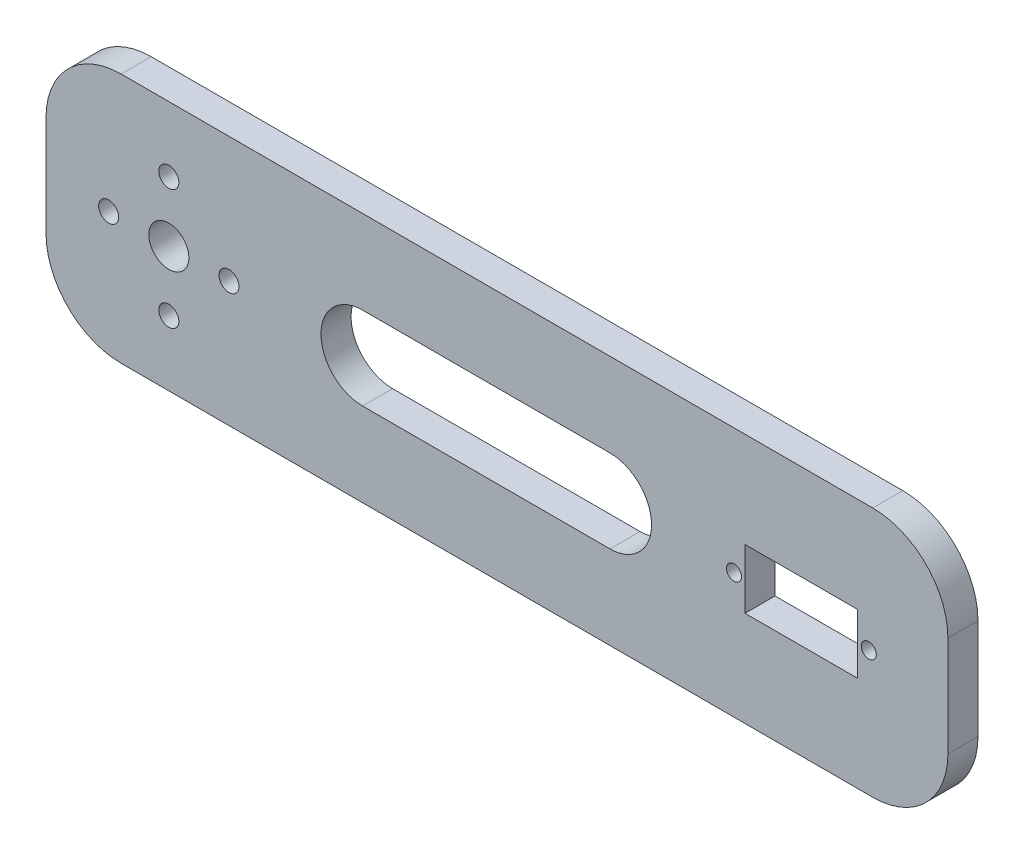
ISO-10303-21;
HEADER;
FILE_DESCRIPTION(('STEP AP214'),'2;1');
FILE_NAME('part.step','',(''),(''),'','','');
FILE_SCHEMA(('AUTOMOTIVE_DESIGN { 1 0 10303 214 1 1 1 1 }'));
ENDSEC;
DATA;
#1=APPLICATION_CONTEXT('core data for automotive mechanical design processes');
#2=APPLICATION_PROTOCOL_DEFINITION('international standard','automotive_design',2000,#1);
#3=PRODUCT_CONTEXT('',#1,'mechanical');
#4=PRODUCT('Part','Part','',(#3));
#5=PRODUCT_RELATED_PRODUCT_CATEGORY('part','',(#4));
#6=PRODUCT_DEFINITION_FORMATION('','',#4);
#7=PRODUCT_DEFINITION_CONTEXT('part definition',#1,'design');
#8=PRODUCT_DEFINITION('design','',#6,#7);
#9=PRODUCT_DEFINITION_SHAPE('','',#8);
#10=(LENGTH_UNIT() NAMED_UNIT(*) SI_UNIT(.MILLI.,.METRE.));
#11=(NAMED_UNIT(*) PLANE_ANGLE_UNIT() SI_UNIT($,.RADIAN.));
#12=(NAMED_UNIT(*) SI_UNIT($,.STERADIAN.) SOLID_ANGLE_UNIT());
#13=UNCERTAINTY_MEASURE_WITH_UNIT(LENGTH_MEASURE(1.E-05),#10,'distance_accuracy_value','');
#14=(GEOMETRIC_REPRESENTATION_CONTEXT(3) GLOBAL_UNCERTAINTY_ASSIGNED_CONTEXT((#13)) GLOBAL_UNIT_ASSIGNED_CONTEXT((#10,
#11,#12)) REPRESENTATION_CONTEXT('',''));
#15=CARTESIAN_POINT('',(0.,0.,0.));
#16=DIRECTION('',(0.,0.,1.));
#17=DIRECTION('',(1.,0.,0.));
#18=AXIS2_PLACEMENT_3D('',#15,#16,#17);
#19=CARTESIAN_POINT('',(107.559596495317,25.,3.));
#20=DIRECTION('',(-1.,0.,0.));
#21=DIRECTION('',(0.,0.,1.));
#22=AXIS2_PLACEMENT_3D('',#19,#20,#21);
#23=PLANE('',#22);
#24=DIRECTION('',(0.,1.,0.));
#25=VECTOR('',#24,1.);
#26=CARTESIAN_POINT('',(107.559596495317,25.,3.));
#27=LINE('',#26,#25);
#28=CARTESIAN_POINT('',(107.559596495317,-10.,3.));
#29=VERTEX_POINT('',#28);
#30=CARTESIAN_POINT('',(107.559596495317,10.,3.));
#31=VERTEX_POINT('',#30);
#32=EDGE_CURVE('E216',#29,#31,#27,.T.);
#33=ORIENTED_EDGE('',*,*,#32,.F.);
#34=DIRECTION('',(0.,0.,-1.));
#35=VECTOR('',#34,1.);
#36=CARTESIAN_POINT('',(107.559596495317,-10.,3.));
#37=LINE('',#36,#35);
#38=CARTESIAN_POINT('',(107.559596495317,-10.,-3.));
#39=VERTEX_POINT('',#38);
#40=EDGE_CURVE('E243',#29,#39,#37,.T.);
#41=ORIENTED_EDGE('',*,*,#40,.T.);
#42=DIRECTION('',(0.,1.,0.));
#43=VECTOR('',#42,1.);
#44=CARTESIAN_POINT('',(107.559596495317,25.,-3.));
#45=LINE('',#44,#43);
#46=CARTESIAN_POINT('',(107.559596495317,10.,-3.));
#47=VERTEX_POINT('',#46);
#48=EDGE_CURVE('E230',#39,#47,#45,.T.);
#49=ORIENTED_EDGE('',*,*,#48,.T.);
#50=DIRECTION('',(0.,0.,-1.));
#51=VECTOR('',#50,1.);
#52=CARTESIAN_POINT('',(107.559596495317,10.,3.));
#53=LINE('',#52,#51);
#54=EDGE_CURVE('E229',#47,#31,#53,.F.);
#55=ORIENTED_EDGE('',*,*,#54,.T.);
#56=EDGE_LOOP('',(#33,#41,#49,#55));
#57=FACE_BOUND('',#56,.T.);
#58=ADVANCED_FACE('F32',(#57),#23,.F.);
#59=CARTESIAN_POINT('',(-72.4404035046829,25.,3.));
#60=DIRECTION('',(0.,-1.,0.));
#61=DIRECTION('',(0.,0.,-1.));
#62=AXIS2_PLACEMENT_3D('',#59,#60,#61);
#63=PLANE('',#62);
#64=DIRECTION('',(-1.,0.,0.));
#65=VECTOR('',#64,1.);
#66=CARTESIAN_POINT('',(-72.4404035046829,25.,3.));
#67=LINE('',#66,#65);
#68=CARTESIAN_POINT('',(92.5595964953171,25.,3.));
#69=VERTEX_POINT('',#68);
#70=CARTESIAN_POINT('',(-57.4404035046829,25.,3.));
#71=VERTEX_POINT('',#70);
#72=EDGE_CURVE('E219',#69,#71,#67,.T.);
#73=ORIENTED_EDGE('',*,*,#72,.F.);
#74=DIRECTION('',(0.,0.,-1.));
#75=VECTOR('',#74,1.);
#76=CARTESIAN_POINT('',(92.5595964953171,25.,3.));
#77=LINE('',#76,#75);
#78=CARTESIAN_POINT('',(92.5595964953171,25.,-3.));
#79=VERTEX_POINT('',#78);
#80=EDGE_CURVE('E269',#69,#79,#77,.T.);
#81=ORIENTED_EDGE('',*,*,#80,.T.);
#82=DIRECTION('',(-1.,0.,0.));
#83=VECTOR('',#82,1.);
#84=CARTESIAN_POINT('',(-72.4404035046829,25.,-3.));
#85=LINE('',#84,#83);
#86=CARTESIAN_POINT('',(-57.4404035046829,25.,-3.));
#87=VERTEX_POINT('',#86);
#88=EDGE_CURVE('E233',#79,#87,#85,.T.);
#89=ORIENTED_EDGE('',*,*,#88,.T.);
#90=DIRECTION('',(0.,0.,-1.));
#91=VECTOR('',#90,1.);
#92=CARTESIAN_POINT('',(-57.4404035046829,25.,3.));
#93=LINE('',#92,#91);
#94=EDGE_CURVE('E267',#87,#71,#93,.F.);
#95=ORIENTED_EDGE('',*,*,#94,.T.);
#96=EDGE_LOOP('',(#73,#81,#89,#95));
#97=FACE_BOUND('',#96,.T.);
#98=ADVANCED_FACE('F330',(#97),#63,.F.);
#99=CARTESIAN_POINT('',(-72.4404035046829,25.,3.));
#100=DIRECTION('',(1.,0.,0.));
#101=DIRECTION('',(0.,0.,-1.));
#102=AXIS2_PLACEMENT_3D('',#99,#100,#101);
#103=PLANE('',#102);
#104=DIRECTION('',(0.,-1.,0.));
#105=VECTOR('',#104,1.);
#106=CARTESIAN_POINT('',(-72.4404035046829,25.,-3.));
#107=LINE('',#106,#105);
#108=CARTESIAN_POINT('',(-72.4404035046829,10.,-3.));
#109=VERTEX_POINT('',#108);
#110=CARTESIAN_POINT('',(-72.4404035046829,-10.,-3.));
#111=VERTEX_POINT('',#110);
#112=EDGE_CURVE('E237',#109,#111,#107,.T.);
#113=ORIENTED_EDGE('',*,*,#112,.T.);
#114=DIRECTION('',(0.,0.,-1.));
#115=VECTOR('',#114,1.);
#116=CARTESIAN_POINT('',(-72.4404035046829,-10.,3.));
#117=LINE('',#116,#115);
#118=CARTESIAN_POINT('',(-72.4404035046829,-10.,3.));
#119=VERTEX_POINT('',#118);
#120=EDGE_CURVE('E275',#111,#119,#117,.F.);
#121=ORIENTED_EDGE('',*,*,#120,.T.);
#122=DIRECTION('',(0.,-1.,0.));
#123=VECTOR('',#122,1.);
#124=CARTESIAN_POINT('',(-72.4404035046829,25.,3.));
#125=LINE('',#124,#123);
#126=CARTESIAN_POINT('',(-72.4404035046829,10.,3.));
#127=VERTEX_POINT('',#126);
#128=EDGE_CURVE('E223',#127,#119,#125,.T.);
#129=ORIENTED_EDGE('',*,*,#128,.F.);
#130=DIRECTION('',(0.,0.,-1.));
#131=VECTOR('',#130,1.);
#132=CARTESIAN_POINT('',(-72.4404035046829,10.,3.));
#133=LINE('',#132,#131);
#134=EDGE_CURVE('E272',#127,#109,#133,.T.);
#135=ORIENTED_EDGE('',*,*,#134,.T.);
#136=EDGE_LOOP('',(#113,#121,#129,#135));
#137=FACE_BOUND('',#136,.T.);
#138=ADVANCED_FACE('F336',(#137),#103,.F.);
#139=CARTESIAN_POINT('',(-72.4404035046829,-25.,3.));
#140=DIRECTION('',(0.,1.,0.));
#141=DIRECTION('',(0.,0.,1.));
#142=AXIS2_PLACEMENT_3D('',#139,#140,#141);
#143=PLANE('',#142);
#144=DIRECTION('',(1.,0.,0.));
#145=VECTOR('',#144,1.);
#146=CARTESIAN_POINT('',(-72.4404035046829,-25.,-3.));
#147=LINE('',#146,#145);
#148=CARTESIAN_POINT('',(-57.4404035046829,-25.,-3.));
#149=VERTEX_POINT('',#148);
#150=CARTESIAN_POINT('',(92.5595964953171,-25.,-3.));
#151=VERTEX_POINT('',#150);
#152=EDGE_CURVE('E220',#149,#151,#147,.T.);
#153=ORIENTED_EDGE('',*,*,#152,.T.);
#154=DIRECTION('',(0.,0.,-1.));
#155=VECTOR('',#154,1.);
#156=CARTESIAN_POINT('',(92.5595964953171,-25.,3.));
#157=LINE('',#156,#155);
#158=CARTESIAN_POINT('',(92.5595964953171,-25.,3.));
#159=VERTEX_POINT('',#158);
#160=EDGE_CURVE('E257',#151,#159,#157,.F.);
#161=ORIENTED_EDGE('',*,*,#160,.T.);
#162=DIRECTION('',(1.,0.,0.));
#163=VECTOR('',#162,1.);
#164=CARTESIAN_POINT('',(-72.4404035046829,-25.,3.));
#165=LINE('',#164,#163);
#166=CARTESIAN_POINT('',(-57.4404035046829,-25.,3.));
#167=VERTEX_POINT('',#166);
#168=EDGE_CURVE('E226',#167,#159,#165,.T.);
#169=ORIENTED_EDGE('',*,*,#168,.F.);
#170=DIRECTION('',(0.,0.,-1.));
#171=VECTOR('',#170,1.);
#172=CARTESIAN_POINT('',(-57.4404035046829,-25.,3.));
#173=LINE('',#172,#171);
#174=EDGE_CURVE('E254',#167,#149,#173,.T.);
#175=ORIENTED_EDGE('',*,*,#174,.T.);
#176=EDGE_LOOP('',(#153,#161,#169,#175));
#177=FACE_BOUND('',#176,.T.);
#178=ADVANCED_FACE('F365',(#177),#143,.F.);
#179=CARTESIAN_POINT('',(0.,0.,3.));
#180=DIRECTION('',(0.,0.,1.));
#181=DIRECTION('',(1.,0.,0.));
#182=AXIS2_PLACEMENT_3D('',#179,#180,#181);
#183=PLANE('',#182);
#184=CARTESIAN_POINT('',(-9.26986898733187,0.,3.));
#185=DIRECTION('',(0.,0.,1.));
#186=DIRECTION('',(1.,0.,0.));
#187=AXIS2_PLACEMENT_3D('',#184,#185,#186);
#188=CIRCLE('',#187,8.28786760555537);
#189=CARTESIAN_POINT('',(-9.26986898733187,8.28786760555537,3.));
#190=VERTEX_POINT('',#189);
#191=CARTESIAN_POINT('',(-9.26986898733187,-8.28786760555537,3.));
#192=VERTEX_POINT('',#191);
#193=EDGE_CURVE('E47',#190,#192,#188,.T.);
#194=ORIENTED_EDGE('',*,*,#193,.F.);
#195=DIRECTION('',(-1.,0.,0.));
#196=VECTOR('',#195,1.);
#197=CARTESIAN_POINT('',(-9.26986898733187,8.28786760555537,3.));
#198=LINE('',#197,#196);
#199=CARTESIAN_POINT('',(40.1159802573504,8.28786760555537,3.));
#200=VERTEX_POINT('',#199);
#201=EDGE_CURVE('E169',#200,#190,#198,.T.);
#202=ORIENTED_EDGE('',*,*,#201,.F.);
#203=CARTESIAN_POINT('',(40.1159802573504,0.,3.));
#204=DIRECTION('',(0.,0.,1.));
#205=DIRECTION('',(1.,0.,0.));
#206=AXIS2_PLACEMENT_3D('',#203,#204,#205);
#207=CIRCLE('',#206,8.28786760555537);
#208=CARTESIAN_POINT('',(40.1159802573504,-8.28786760555537,3.));
#209=VERTEX_POINT('',#208);
#210=EDGE_CURVE('E152',#209,#200,#207,.T.);
#211=ORIENTED_EDGE('',*,*,#210,.F.);
#212=DIRECTION('',(1.,0.,0.));
#213=VECTOR('',#212,1.);
#214=CARTESIAN_POINT('',(-9.26986898733187,-8.28786760555537,3.));
#215=LINE('',#214,#213);
#216=EDGE_CURVE('E162',#192,#209,#215,.T.);
#217=ORIENTED_EDGE('',*,*,#216,.F.);
#218=EDGE_LOOP('',(#194,#202,#211,#217));
#219=FACE_BOUND('',#218,.T.);
#220=CARTESIAN_POINT('',(91.7595964953171,0.,3.));
#221=DIRECTION('',(0.,0.,1.));
#222=DIRECTION('',(1.,0.,0.));
#223=AXIS2_PLACEMENT_3D('',#220,#221,#222);
#224=CIRCLE('',#223,1.5);
#225=CARTESIAN_POINT('',(93.2595964953171,0.,3.));
#226=VERTEX_POINT('',#225);
#227=EDGE_CURVE('E176',#226,#226,#224,.T.);
#228=ORIENTED_EDGE('',*,*,#227,.F.);
#229=EDGE_LOOP('',(#228));
#230=FACE_BOUND('',#229,.T.);
#231=CARTESIAN_POINT('',(64.8595964953171,0.,3.));
#232=DIRECTION('',(0.,0.,1.));
#233=DIRECTION('',(1.,0.,0.));
#234=AXIS2_PLACEMENT_3D('',#231,#232,#233);
#235=CIRCLE('',#234,1.5);
#236=CARTESIAN_POINT('',(66.3595964953171,0.,3.));
#237=VERTEX_POINT('',#236);
#238=EDGE_CURVE('E181',#237,#237,#235,.T.);
#239=ORIENTED_EDGE('',*,*,#238,.F.);
#240=EDGE_LOOP('',(#239));
#241=FACE_BOUND('',#240,.T.);
#242=DIRECTION('',(0.,1.,0.));
#243=VECTOR('',#242,1.);
#244=CARTESIAN_POINT('',(89.5595964953171,5.95,3.));
#245=LINE('',#244,#243);
#246=CARTESIAN_POINT('',(89.5595964953171,-5.95,3.));
#247=VERTEX_POINT('',#246);
#248=CARTESIAN_POINT('',(89.5595964953171,5.95,3.));
#249=VERTEX_POINT('',#248);
#250=EDGE_CURVE('E55',#247,#249,#245,.T.);
#251=ORIENTED_EDGE('',*,*,#250,.F.);
#252=DIRECTION('',(1.,0.,0.));
#253=VECTOR('',#252,1.);
#254=CARTESIAN_POINT('',(67.0595964953171,-5.95,3.));
#255=LINE('',#254,#253);
#256=CARTESIAN_POINT('',(67.0595964953171,-5.95,3.));
#257=VERTEX_POINT('',#256);
#258=EDGE_CURVE('E187',#257,#247,#255,.T.);
#259=ORIENTED_EDGE('',*,*,#258,.F.);
#260=DIRECTION('',(0.,-1.,0.));
#261=VECTOR('',#260,1.);
#262=CARTESIAN_POINT('',(67.0595964953171,5.95,3.));
#263=LINE('',#262,#261);
#264=CARTESIAN_POINT('',(67.0595964953171,5.95,3.));
#265=VERTEX_POINT('',#264);
#266=EDGE_CURVE('E184',#265,#257,#263,.T.);
#267=ORIENTED_EDGE('',*,*,#266,.F.);
#268=DIRECTION('',(-1.,0.,0.));
#269=VECTOR('',#268,1.);
#270=CARTESIAN_POINT('',(67.0595964953171,5.95,3.));
#271=LINE('',#270,#269);
#272=EDGE_CURVE('E180',#249,#265,#271,.T.);
#273=ORIENTED_EDGE('',*,*,#272,.F.);
#274=EDGE_LOOP('',(#251,#259,#267,#273));
#275=FACE_BOUND('',#274,.T.);
#276=CARTESIAN_POINT('',(-47.9261637065995,12.,3.));
#277=DIRECTION('',(0.,0.,1.));
#278=DIRECTION('',(1.,0.,0.));
#279=AXIS2_PLACEMENT_3D('',#276,#277,#278);
#280=CIRCLE('',#279,2.);
#281=CARTESIAN_POINT('',(-45.9261637065995,12.,3.));
#282=VERTEX_POINT('',#281);
#283=EDGE_CURVE('E207',#282,#282,#280,.T.);
#284=ORIENTED_EDGE('',*,*,#283,.F.);
#285=EDGE_LOOP('',(#284));
#286=FACE_BOUND('',#285,.T.);
#287=CARTESIAN_POINT('',(-47.9261637065995,-12.,3.));
#288=DIRECTION('',(0.,0.,1.));
#289=DIRECTION('',(-1.,0.,0.));
#290=AXIS2_PLACEMENT_3D('',#287,#288,#289);
#291=CIRCLE('',#290,2.);
#292=CARTESIAN_POINT('',(-49.9261637065995,-12.,3.));
#293=VERTEX_POINT('',#292);
#294=EDGE_CURVE('E202',#293,#293,#291,.T.);
#295=ORIENTED_EDGE('',*,*,#294,.F.);
#296=EDGE_LOOP('',(#295));
#297=FACE_BOUND('',#296,.T.);
#298=CARTESIAN_POINT('',(-59.9261637065995,0.,3.));
#299=DIRECTION('',(0.,0.,1.));
#300=DIRECTION('',(1.,0.,0.));
#301=AXIS2_PLACEMENT_3D('',#298,#299,#300);
#302=CIRCLE('',#301,2.);
#303=CARTESIAN_POINT('',(-57.9261637065995,0.,3.));
#304=VERTEX_POINT('',#303);
#305=EDGE_CURVE('E199',#304,#304,#302,.T.);
#306=ORIENTED_EDGE('',*,*,#305,.F.);
#307=EDGE_LOOP('',(#306));
#308=FACE_BOUND('',#307,.T.);
#309=CARTESIAN_POINT('',(-35.9261637065995,0.,3.));
#310=DIRECTION('',(0.,0.,1.));
#311=DIRECTION('',(-1.,0.,0.));
#312=AXIS2_PLACEMENT_3D('',#309,#310,#311);
#313=CIRCLE('',#312,2.);
#314=CARTESIAN_POINT('',(-37.9261637065995,0.,3.));
#315=VERTEX_POINT('',#314);
#316=EDGE_CURVE('E203',#315,#315,#313,.T.);
#317=ORIENTED_EDGE('',*,*,#316,.F.);
#318=EDGE_LOOP('',(#317));
#319=FACE_BOUND('',#318,.T.);
#320=CARTESIAN_POINT('',(-47.9261637065995,0.,3.));
#321=DIRECTION('',(0.,0.,1.));
#322=DIRECTION('',(1.,0.,0.));
#323=AXIS2_PLACEMENT_3D('',#320,#321,#322);
#324=CIRCLE('',#323,4.00000000000001);
#325=CARTESIAN_POINT('',(-43.9261637065995,0.,3.));
#326=VERTEX_POINT('',#325);
#327=EDGE_CURVE('E210',#326,#326,#324,.T.);
#328=ORIENTED_EDGE('',*,*,#327,.F.);
#329=EDGE_LOOP('',(#328));
#330=FACE_BOUND('',#329,.T.);
#331=ORIENTED_EDGE('',*,*,#168,.T.);
#332=CARTESIAN_POINT('',(92.5595964953171,-10.,3.));
#333=DIRECTION('',(0.,0.,1.));
#334=DIRECTION('',(1.,0.,0.));
#335=AXIS2_PLACEMENT_3D('',#332,#333,#334);
#336=CIRCLE('',#335,15.);
#337=EDGE_CURVE('E265',#159,#29,#336,.T.);
#338=ORIENTED_EDGE('',*,*,#337,.T.);
#339=ORIENTED_EDGE('',*,*,#32,.T.);
#340=CARTESIAN_POINT('',(92.5595964953171,10.,3.));
#341=DIRECTION('',(0.,0.,1.));
#342=DIRECTION('',(1.,0.,0.));
#343=AXIS2_PLACEMENT_3D('',#340,#341,#342);
#344=CIRCLE('',#343,15.);
#345=EDGE_CURVE('E263',#31,#69,#344,.T.);
#346=ORIENTED_EDGE('',*,*,#345,.T.);
#347=ORIENTED_EDGE('',*,*,#72,.T.);
#348=CARTESIAN_POINT('',(-57.4404035046829,10.,3.));
#349=DIRECTION('',(0.,0.,1.));
#350=DIRECTION('',(1.,0.,0.));
#351=AXIS2_PLACEMENT_3D('',#348,#349,#350);
#352=CIRCLE('',#351,15.);
#353=EDGE_CURVE('E259',#71,#127,#352,.T.);
#354=ORIENTED_EDGE('',*,*,#353,.T.);
#355=ORIENTED_EDGE('',*,*,#128,.T.);
#356=CARTESIAN_POINT('',(-57.4404035046829,-10.,3.));
#357=DIRECTION('',(0.,0.,1.));
#358=DIRECTION('',(1.,0.,0.));
#359=AXIS2_PLACEMENT_3D('',#356,#357,#358);
#360=CIRCLE('',#359,15.);
#361=EDGE_CURVE('E261',#119,#167,#360,.T.);
#362=ORIENTED_EDGE('',*,*,#361,.T.);
#363=EDGE_LOOP('',(#331,#338,#339,#346,#347,#354,#355,#362));
#364=FACE_BOUND('',#363,.T.);
#365=ADVANCED_FACE('F166',(#219,#230,#241,#275,#286,#297,#308,#319,#330,#364),#183,.T.);
#366=CARTESIAN_POINT('',(0.,0.,-3.));
#367=DIRECTION('',(0.,0.,1.));
#368=DIRECTION('',(1.,0.,0.));
#369=AXIS2_PLACEMENT_3D('',#366,#367,#368);
#370=PLANE('',#369);
#371=DIRECTION('',(-1.,0.,0.));
#372=VECTOR('',#371,1.);
#373=CARTESIAN_POINT('',(0.,8.28786760555537,-3.));
#374=LINE('',#373,#372);
#375=CARTESIAN_POINT('',(40.1159802573504,8.28786760555537,-3.));
#376=VERTEX_POINT('',#375);
#377=CARTESIAN_POINT('',(-9.26986898733187,8.28786760555537,-3.));
#378=VERTEX_POINT('',#377);
#379=EDGE_CURVE('E40',#376,#378,#374,.T.);
#380=ORIENTED_EDGE('',*,*,#379,.T.);
#381=CARTESIAN_POINT('',(-9.26986898733187,0.,-3.));
#382=DIRECTION('',(0.,0.,1.));
#383=DIRECTION('',(1.,0.,0.));
#384=AXIS2_PLACEMENT_3D('',#381,#382,#383);
#385=CIRCLE('',#384,8.28786760555537);
#386=CARTESIAN_POINT('',(-9.26986898733187,-8.28786760555537,-3.));
#387=VERTEX_POINT('',#386);
#388=EDGE_CURVE('E11',#378,#387,#385,.T.);
#389=ORIENTED_EDGE('',*,*,#388,.T.);
#390=DIRECTION('',(1.,0.,0.));
#391=VECTOR('',#390,1.);
#392=CARTESIAN_POINT('',(0.,-8.28786760555537,-3.));
#393=LINE('',#392,#391);
#394=CARTESIAN_POINT('',(40.1159802573504,-8.28786760555537,-3.));
#395=VERTEX_POINT('',#394);
#396=EDGE_CURVE('E302',#387,#395,#393,.T.);
#397=ORIENTED_EDGE('',*,*,#396,.T.);
#398=CARTESIAN_POINT('',(40.1159802573504,0.,-3.));
#399=DIRECTION('',(0.,0.,1.));
#400=DIRECTION('',(1.,0.,0.));
#401=AXIS2_PLACEMENT_3D('',#398,#399,#400);
#402=CIRCLE('',#401,8.28786760555537);
#403=EDGE_CURVE('E155',#395,#376,#402,.T.);
#404=ORIENTED_EDGE('',*,*,#403,.T.);
#405=EDGE_LOOP('',(#380,#389,#397,#404));
#406=FACE_BOUND('',#405,.T.);
#407=CARTESIAN_POINT('',(91.7595964953171,0.,-3.));
#408=DIRECTION('',(0.,0.,1.));
#409=DIRECTION('',(1.,0.,0.));
#410=AXIS2_PLACEMENT_3D('',#407,#408,#409);
#411=CIRCLE('',#410,1.5);
#412=CARTESIAN_POINT('',(93.2595964953171,0.,-3.));
#413=VERTEX_POINT('',#412);
#414=EDGE_CURVE('E206',#413,#413,#411,.T.);
#415=ORIENTED_EDGE('',*,*,#414,.T.);
#416=EDGE_LOOP('',(#415));
#417=FACE_BOUND('',#416,.T.);
#418=CARTESIAN_POINT('',(64.8595964953171,0.,-3.));
#419=DIRECTION('',(0.,0.,1.));
#420=DIRECTION('',(1.,0.,0.));
#421=AXIS2_PLACEMENT_3D('',#418,#419,#420);
#422=CIRCLE('',#421,1.5);
#423=CARTESIAN_POINT('',(66.3595964953171,0.,-3.));
#424=VERTEX_POINT('',#423);
#425=EDGE_CURVE('E193',#424,#424,#422,.T.);
#426=ORIENTED_EDGE('',*,*,#425,.T.);
#427=EDGE_LOOP('',(#426));
#428=FACE_BOUND('',#427,.T.);
#429=DIRECTION('',(1.,0.,0.));
#430=VECTOR('',#429,1.);
#431=CARTESIAN_POINT('',(0.,-5.95000000000001,-3.));
#432=LINE('',#431,#430);
#433=CARTESIAN_POINT('',(67.0595964953171,-5.95,-3.));
#434=VERTEX_POINT('',#433);
#435=CARTESIAN_POINT('',(89.5595964953171,-5.95,-3.));
#436=VERTEX_POINT('',#435);
#437=EDGE_CURVE('E296',#434,#436,#432,.T.);
#438=ORIENTED_EDGE('',*,*,#437,.T.);
#439=DIRECTION('',(0.,1.,0.));
#440=VECTOR('',#439,1.);
#441=CARTESIAN_POINT('',(89.5595964953171,0.,-3.));
#442=LINE('',#441,#440);
#443=CARTESIAN_POINT('',(89.5595964953171,5.95,-3.));
#444=VERTEX_POINT('',#443);
#445=EDGE_CURVE('E299',#436,#444,#442,.T.);
#446=ORIENTED_EDGE('',*,*,#445,.T.);
#447=DIRECTION('',(-1.,0.,0.));
#448=VECTOR('',#447,1.);
#449=CARTESIAN_POINT('',(0.,5.95,-3.));
#450=LINE('',#449,#448);
#451=CARTESIAN_POINT('',(67.0595964953171,5.95,-3.));
#452=VERTEX_POINT('',#451);
#453=EDGE_CURVE('E277',#444,#452,#450,.T.);
#454=ORIENTED_EDGE('',*,*,#453,.T.);
#455=DIRECTION('',(0.,-1.,0.));
#456=VECTOR('',#455,1.);
#457=CARTESIAN_POINT('',(67.0595964953171,0.,-3.));
#458=LINE('',#457,#456);
#459=EDGE_CURVE('E293',#452,#434,#458,.T.);
#460=ORIENTED_EDGE('',*,*,#459,.T.);
#461=EDGE_LOOP('',(#438,#446,#454,#460));
#462=FACE_BOUND('',#461,.T.);
#463=CARTESIAN_POINT('',(-47.9261637065995,12.,-3.));
#464=DIRECTION('',(0.,0.,1.));
#465=DIRECTION('',(1.,0.,0.));
#466=AXIS2_PLACEMENT_3D('',#463,#464,#465);
#467=CIRCLE('',#466,2.);
#468=CARTESIAN_POINT('',(-45.9261637065995,12.,-3.));
#469=VERTEX_POINT('',#468);
#470=EDGE_CURVE('E234',#469,#469,#467,.T.);
#471=ORIENTED_EDGE('',*,*,#470,.T.);
#472=EDGE_LOOP('',(#471));
#473=FACE_BOUND('',#472,.T.);
#474=CARTESIAN_POINT('',(-47.9261637065995,-12.,-3.));
#475=DIRECTION('',(0.,0.,1.));
#476=DIRECTION('',(1.,0.,0.));
#477=AXIS2_PLACEMENT_3D('',#474,#475,#476);
#478=CIRCLE('',#477,2.);
#479=CARTESIAN_POINT('',(-45.9261637065995,-12.,-3.));
#480=VERTEX_POINT('',#479);
#481=EDGE_CURVE('E286',#480,#480,#478,.T.);
#482=ORIENTED_EDGE('',*,*,#481,.T.);
#483=EDGE_LOOP('',(#482));
#484=FACE_BOUND('',#483,.T.);
#485=CARTESIAN_POINT('',(-59.9261637065995,0.,-3.));
#486=DIRECTION('',(0.,0.,1.));
#487=DIRECTION('',(1.,0.,0.));
#488=AXIS2_PLACEMENT_3D('',#485,#486,#487);
#489=CIRCLE('',#488,2.);
#490=CARTESIAN_POINT('',(-57.9261637065995,0.,-3.));
#491=VERTEX_POINT('',#490);
#492=EDGE_CURVE('E283',#491,#491,#489,.T.);
#493=ORIENTED_EDGE('',*,*,#492,.T.);
#494=EDGE_LOOP('',(#493));
#495=FACE_BOUND('',#494,.T.);
#496=CARTESIAN_POINT('',(-35.9261637065995,0.,-3.));
#497=DIRECTION('',(0.,0.,1.));
#498=DIRECTION('',(1.,0.,0.));
#499=AXIS2_PLACEMENT_3D('',#496,#497,#498);
#500=CIRCLE('',#499,2.);
#501=CARTESIAN_POINT('',(-33.9261637065995,0.,-3.));
#502=VERTEX_POINT('',#501);
#503=EDGE_CURVE('E280',#502,#502,#500,.T.);
#504=ORIENTED_EDGE('',*,*,#503,.T.);
#505=EDGE_LOOP('',(#504));
#506=FACE_BOUND('',#505,.T.);
#507=CARTESIAN_POINT('',(-47.9261637065995,0.,-3.));
#508=DIRECTION('',(0.,0.,1.));
#509=DIRECTION('',(1.,0.,0.));
#510=AXIS2_PLACEMENT_3D('',#507,#508,#509);
#511=CIRCLE('',#510,4.00000000000001);
#512=CARTESIAN_POINT('',(-43.9261637065995,0.,-3.));
#513=VERTEX_POINT('',#512);
#514=EDGE_CURVE('E215',#513,#513,#511,.T.);
#515=ORIENTED_EDGE('',*,*,#514,.T.);
#516=EDGE_LOOP('',(#515));
#517=FACE_BOUND('',#516,.T.);
#518=ORIENTED_EDGE('',*,*,#48,.F.);
#519=CARTESIAN_POINT('',(92.5595964953171,-10.,-3.));
#520=DIRECTION('',(0.,0.,1.));
#521=DIRECTION('',(1.,0.,0.));
#522=AXIS2_PLACEMENT_3D('',#519,#520,#521);
#523=CIRCLE('',#522,15.);
#524=EDGE_CURVE('E252',#39,#151,#523,.F.);
#525=ORIENTED_EDGE('',*,*,#524,.T.);
#526=ORIENTED_EDGE('',*,*,#152,.F.);
#527=CARTESIAN_POINT('',(-57.4404035046829,-10.,-3.));
#528=DIRECTION('',(0.,0.,1.));
#529=DIRECTION('',(1.,0.,0.));
#530=AXIS2_PLACEMENT_3D('',#527,#528,#529);
#531=CIRCLE('',#530,15.);
#532=EDGE_CURVE('E248',#149,#111,#531,.F.);
#533=ORIENTED_EDGE('',*,*,#532,.T.);
#534=ORIENTED_EDGE('',*,*,#112,.F.);
#535=CARTESIAN_POINT('',(-57.4404035046829,10.,-3.));
#536=DIRECTION('',(0.,0.,1.));
#537=DIRECTION('',(1.,0.,0.));
#538=AXIS2_PLACEMENT_3D('',#535,#536,#537);
#539=CIRCLE('',#538,15.);
#540=EDGE_CURVE('E246',#109,#87,#539,.F.);
#541=ORIENTED_EDGE('',*,*,#540,.T.);
#542=ORIENTED_EDGE('',*,*,#88,.F.);
#543=CARTESIAN_POINT('',(92.5595964953171,10.,-3.));
#544=DIRECTION('',(0.,0.,1.));
#545=DIRECTION('',(1.,0.,0.));
#546=AXIS2_PLACEMENT_3D('',#543,#544,#545);
#547=CIRCLE('',#546,15.);
#548=EDGE_CURVE('E250',#79,#47,#547,.F.);
#549=ORIENTED_EDGE('',*,*,#548,.T.);
#550=EDGE_LOOP('',(#518,#525,#526,#533,#534,#541,#542,#549));
#551=FACE_BOUND('',#550,.T.);
#552=ADVANCED_FACE('F310',(#406,#417,#428,#462,#473,#484,#495,#506,#517,#551),#370,.F.);
#553=CARTESIAN_POINT('',(92.5595964953171,-10.,3.));
#554=DIRECTION('',(0.,0.,-1.));
#555=DIRECTION('',(-1.,0.,0.));
#556=AXIS2_PLACEMENT_3D('',#553,#554,#555);
#557=CYLINDRICAL_SURFACE('',#556,15.);
#558=ORIENTED_EDGE('',*,*,#337,.F.);
#559=ORIENTED_EDGE('',*,*,#160,.F.);
#560=ORIENTED_EDGE('',*,*,#524,.F.);
#561=ORIENTED_EDGE('',*,*,#40,.F.);
#562=EDGE_LOOP('',(#558,#559,#560,#561));
#563=FACE_BOUND('',#562,.T.);
#564=ADVANCED_FACE('F342',(#563),#557,.T.);
#565=CARTESIAN_POINT('',(92.5595964953171,10.,3.));
#566=DIRECTION('',(0.,0.,-1.));
#567=DIRECTION('',(-1.,0.,0.));
#568=AXIS2_PLACEMENT_3D('',#565,#566,#567);
#569=CYLINDRICAL_SURFACE('',#568,15.);
#570=ORIENTED_EDGE('',*,*,#345,.F.);
#571=ORIENTED_EDGE('',*,*,#54,.F.);
#572=ORIENTED_EDGE('',*,*,#548,.F.);
#573=ORIENTED_EDGE('',*,*,#80,.F.);
#574=EDGE_LOOP('',(#570,#571,#572,#573));
#575=FACE_BOUND('',#574,.T.);
#576=ADVANCED_FACE('F345',(#575),#569,.T.);
#577=CARTESIAN_POINT('',(-57.4404035046829,-10.,3.));
#578=DIRECTION('',(0.,0.,-1.));
#579=DIRECTION('',(-1.,0.,0.));
#580=AXIS2_PLACEMENT_3D('',#577,#578,#579);
#581=CYLINDRICAL_SURFACE('',#580,15.);
#582=ORIENTED_EDGE('',*,*,#361,.F.);
#583=ORIENTED_EDGE('',*,*,#120,.F.);
#584=ORIENTED_EDGE('',*,*,#532,.F.);
#585=ORIENTED_EDGE('',*,*,#174,.F.);
#586=EDGE_LOOP('',(#582,#583,#584,#585));
#587=FACE_BOUND('',#586,.T.);
#588=ADVANCED_FACE('F348',(#587),#581,.T.);
#589=CARTESIAN_POINT('',(-57.4404035046829,10.,3.));
#590=DIRECTION('',(0.,0.,-1.));
#591=DIRECTION('',(-1.,0.,0.));
#592=AXIS2_PLACEMENT_3D('',#589,#590,#591);
#593=CYLINDRICAL_SURFACE('',#592,15.);
#594=ORIENTED_EDGE('',*,*,#353,.F.);
#595=ORIENTED_EDGE('',*,*,#94,.F.);
#596=ORIENTED_EDGE('',*,*,#540,.F.);
#597=ORIENTED_EDGE('',*,*,#134,.F.);
#598=EDGE_LOOP('',(#594,#595,#596,#597));
#599=FACE_BOUND('',#598,.T.);
#600=ADVANCED_FACE('F34',(#599),#593,.T.);
#601=CARTESIAN_POINT('',(-47.9261637065995,0.,-5.));
#602=DIRECTION('',(0.,0.,1.));
#603=DIRECTION('',(1.,0.,0.));
#604=AXIS2_PLACEMENT_3D('',#601,#602,#603);
#605=CYLINDRICAL_SURFACE('',#604,4.00000000000001);
#606=ORIENTED_EDGE('',*,*,#327,.T.);
#607=EDGE_LOOP('',(#606));
#608=FACE_BOUND('',#607,.T.);
#609=ORIENTED_EDGE('',*,*,#514,.F.);
#610=EDGE_LOOP('',(#609));
#611=FACE_BOUND('',#610,.T.);
#612=ADVANCED_FACE('F355',(#608,#611),#605,.F.);
#613=CARTESIAN_POINT('',(-35.9261637065995,0.,-5.));
#614=DIRECTION('',(0.,0.,1.));
#615=DIRECTION('',(1.,0.,0.));
#616=AXIS2_PLACEMENT_3D('',#613,#614,#615);
#617=CYLINDRICAL_SURFACE('',#616,2.);
#618=ORIENTED_EDGE('',*,*,#316,.T.);
#619=EDGE_LOOP('',(#618));
#620=FACE_BOUND('',#619,.T.);
#621=ORIENTED_EDGE('',*,*,#503,.F.);
#622=EDGE_LOOP('',(#621));
#623=FACE_BOUND('',#622,.T.);
#624=ADVANCED_FACE('F515',(#620,#623),#617,.F.);
#625=CARTESIAN_POINT('',(-59.9261637065995,0.,-5.));
#626=DIRECTION('',(0.,0.,1.));
#627=DIRECTION('',(1.,0.,0.));
#628=AXIS2_PLACEMENT_3D('',#625,#626,#627);
#629=CYLINDRICAL_SURFACE('',#628,2.);
#630=ORIENTED_EDGE('',*,*,#305,.T.);
#631=EDGE_LOOP('',(#630));
#632=FACE_BOUND('',#631,.T.);
#633=ORIENTED_EDGE('',*,*,#492,.F.);
#634=EDGE_LOOP('',(#633));
#635=FACE_BOUND('',#634,.T.);
#636=ADVANCED_FACE('F520',(#632,#635),#629,.F.);
#637=CARTESIAN_POINT('',(-47.9261637065995,-12.,-5.));
#638=DIRECTION('',(0.,0.,1.));
#639=DIRECTION('',(1.,0.,0.));
#640=AXIS2_PLACEMENT_3D('',#637,#638,#639);
#641=CYLINDRICAL_SURFACE('',#640,2.);
#642=ORIENTED_EDGE('',*,*,#294,.T.);
#643=EDGE_LOOP('',(#642));
#644=FACE_BOUND('',#643,.T.);
#645=ORIENTED_EDGE('',*,*,#481,.F.);
#646=EDGE_LOOP('',(#645));
#647=FACE_BOUND('',#646,.T.);
#648=ADVANCED_FACE('F524',(#644,#647),#641,.F.);
#649=CARTESIAN_POINT('',(-47.9261637065995,12.,-5.));
#650=DIRECTION('',(0.,0.,1.));
#651=DIRECTION('',(1.,0.,0.));
#652=AXIS2_PLACEMENT_3D('',#649,#650,#651);
#653=CYLINDRICAL_SURFACE('',#652,2.);
#654=ORIENTED_EDGE('',*,*,#283,.T.);
#655=EDGE_LOOP('',(#654));
#656=FACE_BOUND('',#655,.T.);
#657=ORIENTED_EDGE('',*,*,#470,.F.);
#658=EDGE_LOOP('',(#657));
#659=FACE_BOUND('',#658,.T.);
#660=ADVANCED_FACE('F410',(#656,#659),#653,.F.);
#661=CARTESIAN_POINT('',(89.5595964953171,5.95,-7.));
#662=DIRECTION('',(1.,0.,0.));
#663=DIRECTION('',(0.,0.,-1.));
#664=AXIS2_PLACEMENT_3D('',#661,#662,#663);
#665=PLANE('',#664);
#666=DIRECTION('',(0.,0.,1.));
#667=VECTOR('',#666,1.);
#668=CARTESIAN_POINT('',(89.5595964953171,-5.95,-7.));
#669=LINE('',#668,#667);
#670=EDGE_CURVE('E191',#436,#247,#669,.T.);
#671=ORIENTED_EDGE('',*,*,#670,.T.);
#672=ORIENTED_EDGE('',*,*,#250,.T.);
#673=DIRECTION('',(0.,0.,1.));
#674=VECTOR('',#673,1.);
#675=CARTESIAN_POINT('',(89.5595964953171,5.95,-7.));
#676=LINE('',#675,#674);
#677=EDGE_CURVE('E190',#444,#249,#676,.T.);
#678=ORIENTED_EDGE('',*,*,#677,.F.);
#679=ORIENTED_EDGE('',*,*,#445,.F.);
#680=EDGE_LOOP('',(#671,#672,#678,#679));
#681=FACE_BOUND('',#680,.T.);
#682=ADVANCED_FACE('F420',(#681),#665,.F.);
#683=CARTESIAN_POINT('',(67.0595964953171,-5.95,-7.));
#684=DIRECTION('',(0.,-1.,0.));
#685=DIRECTION('',(1.,0.,0.));
#686=AXIS2_PLACEMENT_3D('',#683,#684,#685);
#687=PLANE('',#686);
#688=DIRECTION('',(0.,0.,1.));
#689=VECTOR('',#688,1.);
#690=CARTESIAN_POINT('',(67.0595964953171,-5.95,-7.));
#691=LINE('',#690,#689);
#692=EDGE_CURVE('E194',#434,#257,#691,.T.);
#693=ORIENTED_EDGE('',*,*,#692,.T.);
#694=ORIENTED_EDGE('',*,*,#258,.T.);
#695=ORIENTED_EDGE('',*,*,#670,.F.);
#696=ORIENTED_EDGE('',*,*,#437,.F.);
#697=EDGE_LOOP('',(#693,#694,#695,#696));
#698=FACE_BOUND('',#697,.T.);
#699=ADVANCED_FACE('F425',(#698),#687,.F.);
#700=CARTESIAN_POINT('',(67.0595964953171,5.95,-7.));
#701=DIRECTION('',(-1.,0.,0.));
#702=DIRECTION('',(0.,0.,1.));
#703=AXIS2_PLACEMENT_3D('',#700,#701,#702);
#704=PLANE('',#703);
#705=DIRECTION('',(0.,0.,1.));
#706=VECTOR('',#705,1.);
#707=CARTESIAN_POINT('',(67.0595964953171,5.95,-7.));
#708=LINE('',#707,#706);
#709=EDGE_CURVE('E196',#452,#265,#708,.T.);
#710=ORIENTED_EDGE('',*,*,#709,.T.);
#711=ORIENTED_EDGE('',*,*,#266,.T.);
#712=ORIENTED_EDGE('',*,*,#692,.F.);
#713=ORIENTED_EDGE('',*,*,#459,.F.);
#714=EDGE_LOOP('',(#710,#711,#712,#713));
#715=FACE_BOUND('',#714,.T.);
#716=ADVANCED_FACE('F434',(#715),#704,.F.);
#717=CARTESIAN_POINT('',(67.0595964953171,5.95,-7.));
#718=DIRECTION('',(0.,1.,0.));
#719=DIRECTION('',(-1.,0.,0.));
#720=AXIS2_PLACEMENT_3D('',#717,#718,#719);
#721=PLANE('',#720);
#722=ORIENTED_EDGE('',*,*,#677,.T.);
#723=ORIENTED_EDGE('',*,*,#272,.T.);
#724=ORIENTED_EDGE('',*,*,#709,.F.);
#725=ORIENTED_EDGE('',*,*,#453,.F.);
#726=EDGE_LOOP('',(#722,#723,#724,#725));
#727=FACE_BOUND('',#726,.T.);
#728=ADVANCED_FACE('F443',(#727),#721,.F.);
#729=CARTESIAN_POINT('',(64.8595964953171,0.,-7.));
#730=DIRECTION('',(0.,0.,1.));
#731=DIRECTION('',(1.,0.,0.));
#732=AXIS2_PLACEMENT_3D('',#729,#730,#731);
#733=CYLINDRICAL_SURFACE('',#732,1.5);
#734=ORIENTED_EDGE('',*,*,#238,.T.);
#735=EDGE_LOOP('',(#734));
#736=FACE_BOUND('',#735,.T.);
#737=ORIENTED_EDGE('',*,*,#425,.F.);
#738=EDGE_LOOP('',(#737));
#739=FACE_BOUND('',#738,.T.);
#740=ADVANCED_FACE('F324',(#736,#739),#733,.F.);
#741=CARTESIAN_POINT('',(91.7595964953171,0.,-7.));
#742=DIRECTION('',(0.,0.,1.));
#743=DIRECTION('',(1.,0.,0.));
#744=AXIS2_PLACEMENT_3D('',#741,#742,#743);
#745=CYLINDRICAL_SURFACE('',#744,1.5);
#746=ORIENTED_EDGE('',*,*,#227,.T.);
#747=EDGE_LOOP('',(#746));
#748=FACE_BOUND('',#747,.T.);
#749=ORIENTED_EDGE('',*,*,#414,.F.);
#750=EDGE_LOOP('',(#749));
#751=FACE_BOUND('',#750,.T.);
#752=ADVANCED_FACE('F317',(#748,#751),#745,.F.);
#753=CARTESIAN_POINT('',(-9.26986898733187,0.,-7.));
#754=DIRECTION('',(0.,0.,1.));
#755=DIRECTION('',(1.,0.,0.));
#756=AXIS2_PLACEMENT_3D('',#753,#754,#755);
#757=CYLINDRICAL_SURFACE('',#756,8.28786760555537);
#758=DIRECTION('',(0.,0.,1.));
#759=VECTOR('',#758,1.);
#760=CARTESIAN_POINT('',(-9.26986898733187,8.28786760555537,-7.));
#761=LINE('',#760,#759);
#762=EDGE_CURVE('E174',#378,#190,#761,.T.);
#763=ORIENTED_EDGE('',*,*,#762,.T.);
#764=ORIENTED_EDGE('',*,*,#193,.T.);
#765=DIRECTION('',(0.,0.,1.));
#766=VECTOR('',#765,1.);
#767=CARTESIAN_POINT('',(-9.26986898733187,-8.28786760555537,-7.));
#768=LINE('',#767,#766);
#769=EDGE_CURVE('E159',#387,#192,#768,.T.);
#770=ORIENTED_EDGE('',*,*,#769,.F.);
#771=ORIENTED_EDGE('',*,*,#388,.F.);
#772=EDGE_LOOP('',(#763,#764,#770,#771));
#773=FACE_BOUND('',#772,.T.);
#774=ADVANCED_FACE('F315',(#773),#757,.F.);
#775=CARTESIAN_POINT('',(-9.26986898733187,8.28786760555537,-7.));
#776=DIRECTION('',(0.,1.,0.));
#777=DIRECTION('',(0.,0.,1.));
#778=AXIS2_PLACEMENT_3D('',#775,#776,#777);
#779=PLANE('',#778);
#780=DIRECTION('',(0.,0.,1.));
#781=VECTOR('',#780,1.);
#782=CARTESIAN_POINT('',(40.1159802573504,8.28786760555537,-7.));
#783=LINE('',#782,#781);
#784=EDGE_CURVE('E158',#376,#200,#783,.T.);
#785=ORIENTED_EDGE('',*,*,#784,.T.);
#786=ORIENTED_EDGE('',*,*,#201,.T.);
#787=ORIENTED_EDGE('',*,*,#762,.F.);
#788=ORIENTED_EDGE('',*,*,#379,.F.);
#789=EDGE_LOOP('',(#785,#786,#787,#788));
#790=FACE_BOUND('',#789,.T.);
#791=ADVANCED_FACE('F314',(#790),#779,.F.);
#792=CARTESIAN_POINT('',(40.1159802573504,0.,-7.));
#793=DIRECTION('',(0.,0.,1.));
#794=DIRECTION('',(1.,0.,0.));
#795=AXIS2_PLACEMENT_3D('',#792,#793,#794);
#796=CYLINDRICAL_SURFACE('',#795,8.28786760555537);
#797=DIRECTION('',(0.,0.,1.));
#798=VECTOR('',#797,1.);
#799=CARTESIAN_POINT('',(40.1159802573504,-8.28786760555537,-7.));
#800=LINE('',#799,#798);
#801=EDGE_CURVE('E147',#395,#209,#800,.T.);
#802=ORIENTED_EDGE('',*,*,#801,.T.);
#803=ORIENTED_EDGE('',*,*,#210,.T.);
#804=ORIENTED_EDGE('',*,*,#784,.F.);
#805=ORIENTED_EDGE('',*,*,#403,.F.);
#806=EDGE_LOOP('',(#802,#803,#804,#805));
#807=FACE_BOUND('',#806,.T.);
#808=ADVANCED_FACE('F149',(#807),#796,.F.);
#809=CARTESIAN_POINT('',(-9.26986898733187,-8.28786760555537,-7.));
#810=DIRECTION('',(0.,-1.,0.));
#811=DIRECTION('',(0.,0.,-1.));
#812=AXIS2_PLACEMENT_3D('',#809,#810,#811);
#813=PLANE('',#812);
#814=ORIENTED_EDGE('',*,*,#769,.T.);
#815=ORIENTED_EDGE('',*,*,#216,.T.);
#816=ORIENTED_EDGE('',*,*,#801,.F.);
#817=ORIENTED_EDGE('',*,*,#396,.F.);
#818=EDGE_LOOP('',(#814,#815,#816,#817));
#819=FACE_BOUND('',#818,.T.);
#820=ADVANCED_FACE('F163',(#819),#813,.F.);
#821=CLOSED_SHELL('',(#58,#98,#138,#178,#365,#552,#564,#576,#588,#600,#612,#624,#636,#648,#660,
#682,#699,#716,#728,#740,#752,#774,#791,#808,#820));
#822=MANIFOLD_SOLID_BREP('B2',#821);
#823=ADVANCED_BREP_SHAPE_REPRESENTATION('',(#18,#822),#14);
#824=SHAPE_DEFINITION_REPRESENTATION(#9,#823);
ENDSEC;
END-ISO-10303-21;
